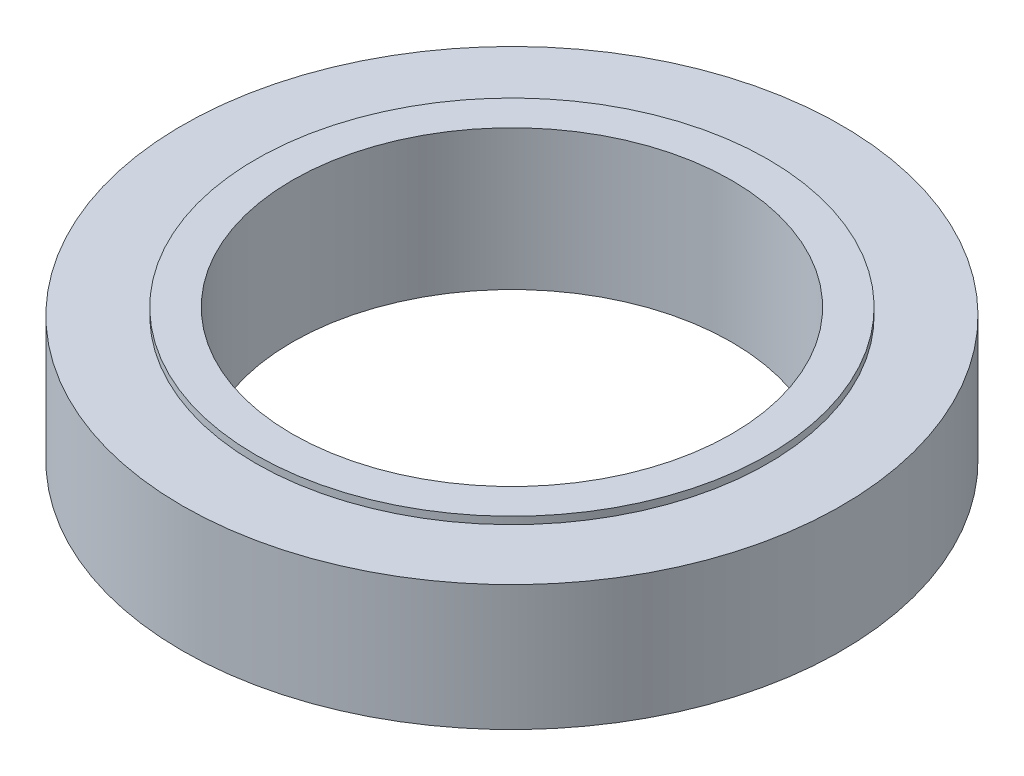
ISO-10303-21;
HEADER;
FILE_DESCRIPTION(('STEP AP214'),'2;1');
FILE_NAME('part.step','',(''),(''),'','','');
FILE_SCHEMA(('AUTOMOTIVE_DESIGN { 1 0 10303 214 1 1 1 1 }'));
ENDSEC;
DATA;
#1=APPLICATION_CONTEXT('core data for automotive mechanical design processes');
#2=APPLICATION_PROTOCOL_DEFINITION('international standard','automotive_design',2000,#1);
#3=PRODUCT_CONTEXT('',#1,'mechanical');
#4=PRODUCT('Part','Part','',(#3));
#5=PRODUCT_RELATED_PRODUCT_CATEGORY('part','',(#4));
#6=PRODUCT_DEFINITION_FORMATION('','',#4);
#7=PRODUCT_DEFINITION_CONTEXT('part definition',#1,'design');
#8=PRODUCT_DEFINITION('design','',#6,#7);
#9=PRODUCT_DEFINITION_SHAPE('','',#8);
#10=(LENGTH_UNIT() NAMED_UNIT(*) SI_UNIT(.MILLI.,.METRE.));
#11=(NAMED_UNIT(*) PLANE_ANGLE_UNIT() SI_UNIT($,.RADIAN.));
#12=(NAMED_UNIT(*) SI_UNIT($,.STERADIAN.) SOLID_ANGLE_UNIT());
#13=UNCERTAINTY_MEASURE_WITH_UNIT(LENGTH_MEASURE(1.E-05),#10,'distance_accuracy_value','');
#14=(GEOMETRIC_REPRESENTATION_CONTEXT(3) GLOBAL_UNCERTAINTY_ASSIGNED_CONTEXT((#13)) GLOBAL_UNIT_ASSIGNED_CONTEXT((#10,
#11,#12)) REPRESENTATION_CONTEXT('',''));
#15=CARTESIAN_POINT('',(0.,0.,0.));
#16=DIRECTION('',(0.,0.,1.));
#17=DIRECTION('',(1.,0.,0.));
#18=AXIS2_PLACEMENT_3D('',#15,#16,#17);
#19=CARTESIAN_POINT('',(0.,3.175,0.));
#20=DIRECTION('',(0.,-1.,0.));
#21=DIRECTION('',(0.,0.,-1.));
#22=AXIS2_PLACEMENT_3D('',#19,#20,#21);
#23=CYLINDRICAL_SURFACE('',#22,16.66875);
#24=CARTESIAN_POINT('',(0.,3.175,0.));
#25=DIRECTION('',(0.,1.,0.));
#26=DIRECTION('',(0.,0.,1.));
#27=AXIS2_PLACEMENT_3D('',#24,#25,#26);
#28=CIRCLE('',#27,16.66875);
#29=CARTESIAN_POINT('',(0.,3.175,16.66875));
#30=VERTEX_POINT('',#29);
#31=EDGE_CURVE('E37',#30,#30,#28,.T.);
#32=ORIENTED_EDGE('',*,*,#31,.F.);
#33=EDGE_LOOP('',(#32));
#34=FACE_BOUND('',#33,.T.);
#35=CARTESIAN_POINT('',(0.,-3.175,0.));
#36=DIRECTION('',(0.,1.,0.));
#37=DIRECTION('',(0.,0.,1.));
#38=AXIS2_PLACEMENT_3D('',#35,#36,#37);
#39=CIRCLE('',#38,16.66875);
#40=CARTESIAN_POINT('',(0.,-3.175,16.66875));
#41=VERTEX_POINT('',#40);
#42=EDGE_CURVE('E41',#41,#41,#39,.T.);
#43=ORIENTED_EDGE('',*,*,#42,.T.);
#44=EDGE_LOOP('',(#43));
#45=FACE_BOUND('',#44,.T.);
#46=ADVANCED_FACE('F31',(#34,#45),#23,.T.);
#47=CARTESIAN_POINT('',(0.,3.175,0.));
#48=DIRECTION('',(0.,1.,0.));
#49=DIRECTION('',(0.,0.,1.));
#50=AXIS2_PLACEMENT_3D('',#47,#48,#49);
#51=PLANE('',#50);
#52=CARTESIAN_POINT('',(0.,3.175,0.));
#53=DIRECTION('',(0.,1.,0.));
#54=DIRECTION('',(0.,0.,1.));
#55=AXIS2_PLACEMENT_3D('',#52,#53,#54);
#56=CIRCLE('',#55,12.954);
#57=CARTESIAN_POINT('',(0.,3.175,12.954));
#58=VERTEX_POINT('',#57);
#59=EDGE_CURVE('E46',#58,#58,#56,.F.);
#60=ORIENTED_EDGE('',*,*,#59,.T.);
#61=EDGE_LOOP('',(#60));
#62=FACE_BOUND('',#61,.T.);
#63=ORIENTED_EDGE('',*,*,#31,.T.);
#64=EDGE_LOOP('',(#63));
#65=FACE_BOUND('',#64,.T.);
#66=ADVANCED_FACE('F87',(#62,#65),#51,.T.);
#67=CARTESIAN_POINT('',(0.,-3.175,0.));
#68=DIRECTION('',(0.,1.,0.));
#69=DIRECTION('',(0.,0.,1.));
#70=AXIS2_PLACEMENT_3D('',#67,#68,#69);
#71=PLANE('',#70);
#72=CARTESIAN_POINT('',(0.,-3.175,0.));
#73=DIRECTION('',(0.,1.,0.));
#74=DIRECTION('',(0.,0.,1.));
#75=AXIS2_PLACEMENT_3D('',#72,#73,#74);
#76=CIRCLE('',#75,12.954);
#77=CARTESIAN_POINT('',(0.,-3.175,12.954));
#78=VERTEX_POINT('',#77);
#79=EDGE_CURVE('E10',#78,#78,#76,.F.);
#80=ORIENTED_EDGE('',*,*,#79,.F.);
#81=EDGE_LOOP('',(#80));
#82=FACE_BOUND('',#81,.T.);
#83=ORIENTED_EDGE('',*,*,#42,.F.);
#84=EDGE_LOOP('',(#83));
#85=FACE_BOUND('',#84,.T.);
#86=ADVANCED_FACE('F92',(#82,#85),#71,.F.);
#87=CARTESIAN_POINT('',(0.,-3.5433,0.));
#88=DIRECTION('',(0.,1.,0.));
#89=DIRECTION('',(0.,0.,1.));
#90=AXIS2_PLACEMENT_3D('',#87,#88,#89);
#91=PLANE('',#90);
#92=CARTESIAN_POINT('',(0.,-3.5433,0.));
#93=DIRECTION('',(0.,1.,0.));
#94=DIRECTION('',(0.,0.,1.));
#95=AXIS2_PLACEMENT_3D('',#92,#93,#94);
#96=CIRCLE('',#95,11.1125);
#97=CARTESIAN_POINT('',(0.,-3.5433,11.1125));
#98=VERTEX_POINT('',#97);
#99=EDGE_CURVE('E55',#98,#98,#96,.T.);
#100=ORIENTED_EDGE('',*,*,#99,.T.);
#101=EDGE_LOOP('',(#100));
#102=FACE_BOUND('',#101,.T.);
#103=CARTESIAN_POINT('',(0.,-3.5433,0.));
#104=DIRECTION('',(0.,1.,0.));
#105=DIRECTION('',(0.,0.,1.));
#106=AXIS2_PLACEMENT_3D('',#103,#104,#105);
#107=CIRCLE('',#106,12.954);
#108=CARTESIAN_POINT('',(0.,-3.5433,12.954));
#109=VERTEX_POINT('',#108);
#110=EDGE_CURVE('E51',#109,#109,#107,.T.);
#111=ORIENTED_EDGE('',*,*,#110,.F.);
#112=EDGE_LOOP('',(#111));
#113=FACE_BOUND('',#112,.T.);
#114=ADVANCED_FACE('F84',(#102,#113),#91,.F.);
#115=CARTESIAN_POINT('',(0.,3.5433,0.));
#116=DIRECTION('',(0.,-1.,0.));
#117=DIRECTION('',(0.,0.,-1.));
#118=AXIS2_PLACEMENT_3D('',#115,#116,#117);
#119=CYLINDRICAL_SURFACE('',#118,12.954);
#120=ORIENTED_EDGE('',*,*,#110,.T.);
#121=EDGE_LOOP('',(#120));
#122=FACE_BOUND('',#121,.T.);
#123=ORIENTED_EDGE('',*,*,#79,.T.);
#124=EDGE_LOOP('',(#123));
#125=FACE_BOUND('',#124,.T.);
#126=ADVANCED_FACE('F75',(#122,#125),#119,.T.);
#127=CARTESIAN_POINT('',(0.,3.175,0.));
#128=DIRECTION('',(0.,-1.,0.));
#129=DIRECTION('',(0.,0.,-1.));
#130=AXIS2_PLACEMENT_3D('',#127,#128,#129);
#131=CYLINDRICAL_SURFACE('',#130,11.1125);
#132=ORIENTED_EDGE('',*,*,#99,.F.);
#133=EDGE_LOOP('',(#132));
#134=FACE_BOUND('',#133,.T.);
#135=CARTESIAN_POINT('',(0.,3.5433,0.));
#136=DIRECTION('',(0.,1.,0.));
#137=DIRECTION('',(0.,0.,1.));
#138=AXIS2_PLACEMENT_3D('',#135,#136,#137);
#139=CIRCLE('',#138,11.1125);
#140=CARTESIAN_POINT('',(0.,3.5433,11.1125));
#141=VERTEX_POINT('',#140);
#142=EDGE_CURVE('E54',#141,#141,#139,.T.);
#143=ORIENTED_EDGE('',*,*,#142,.T.);
#144=EDGE_LOOP('',(#143));
#145=FACE_BOUND('',#144,.T.);
#146=ADVANCED_FACE('F63',(#134,#145),#131,.F.);
#147=ORIENTED_EDGE('',*,*,#59,.F.);
#148=EDGE_LOOP('',(#147));
#149=FACE_BOUND('',#148,.T.);
#150=CARTESIAN_POINT('',(0.,3.5433,0.));
#151=DIRECTION('',(0.,1.,0.));
#152=DIRECTION('',(0.,0.,1.));
#153=AXIS2_PLACEMENT_3D('',#150,#151,#152);
#154=CIRCLE('',#153,12.954);
#155=CARTESIAN_POINT('',(0.,3.5433,12.954));
#156=VERTEX_POINT('',#155);
#157=EDGE_CURVE('E50',#156,#156,#154,.T.);
#158=ORIENTED_EDGE('',*,*,#157,.F.);
#159=EDGE_LOOP('',(#158));
#160=FACE_BOUND('',#159,.T.);
#161=ADVANCED_FACE('F68',(#149,#160),#119,.T.);
#162=CARTESIAN_POINT('',(0.,3.5433,0.));
#163=DIRECTION('',(0.,1.,0.));
#164=DIRECTION('',(0.,0.,1.));
#165=AXIS2_PLACEMENT_3D('',#162,#163,#164);
#166=PLANE('',#165);
#167=ORIENTED_EDGE('',*,*,#142,.F.);
#168=EDGE_LOOP('',(#167));
#169=FACE_BOUND('',#168,.T.);
#170=ORIENTED_EDGE('',*,*,#157,.T.);
#171=EDGE_LOOP('',(#170));
#172=FACE_BOUND('',#171,.T.);
#173=ADVANCED_FACE('F65',(#169,#172),#166,.T.);
#174=CLOSED_SHELL('',(#46,#66,#86,#114,#126,#146,#161,#173));
#175=MANIFOLD_SOLID_BREP('B2',#174);
#176=ADVANCED_BREP_SHAPE_REPRESENTATION('',(#18,#175),#14);
#177=SHAPE_DEFINITION_REPRESENTATION(#9,#176);
ENDSEC;
END-ISO-10303-21;
